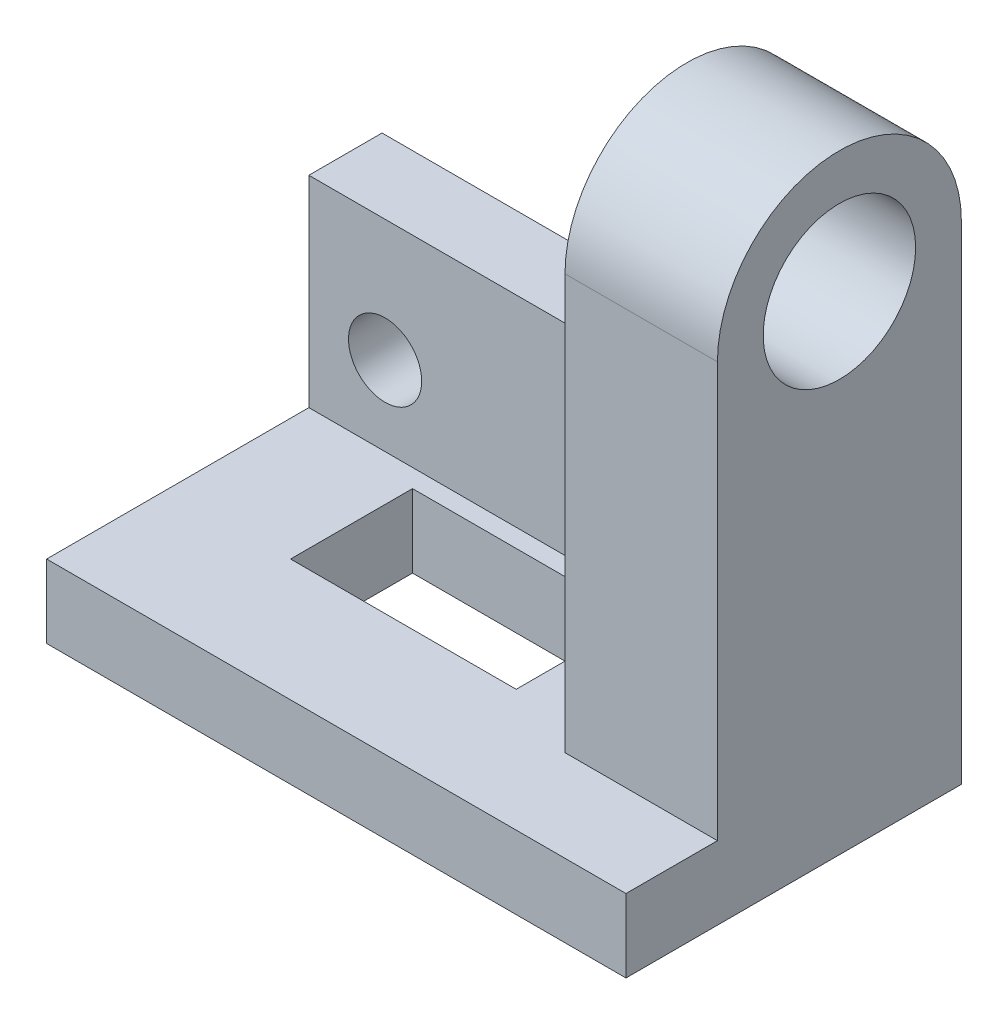
ISO-10303-21;
HEADER;
FILE_DESCRIPTION(('STEP AP214'),'2;1');
FILE_NAME('part.step','',(''),(''),'','','');
FILE_SCHEMA(('AUTOMOTIVE_DESIGN { 1 0 10303 214 1 1 1 1 }'));
ENDSEC;
DATA;
#1=APPLICATION_CONTEXT('core data for automotive mechanical design processes');
#2=APPLICATION_PROTOCOL_DEFINITION('international standard','automotive_design',2000,#1);
#3=PRODUCT_CONTEXT('',#1,'mechanical');
#4=PRODUCT('Part','Part','',(#3));
#5=PRODUCT_RELATED_PRODUCT_CATEGORY('part','',(#4));
#6=PRODUCT_DEFINITION_FORMATION('','',#4);
#7=PRODUCT_DEFINITION_CONTEXT('part definition',#1,'design');
#8=PRODUCT_DEFINITION('design','',#6,#7);
#9=PRODUCT_DEFINITION_SHAPE('','',#8);
#10=(LENGTH_UNIT() NAMED_UNIT(*) SI_UNIT(.MILLI.,.METRE.));
#11=(NAMED_UNIT(*) PLANE_ANGLE_UNIT() SI_UNIT($,.RADIAN.));
#12=(NAMED_UNIT(*) SI_UNIT($,.STERADIAN.) SOLID_ANGLE_UNIT());
#13=UNCERTAINTY_MEASURE_WITH_UNIT(LENGTH_MEASURE(1.E-05),#10,'distance_accuracy_value','');
#14=(GEOMETRIC_REPRESENTATION_CONTEXT(3) GLOBAL_UNCERTAINTY_ASSIGNED_CONTEXT((#13)) GLOBAL_UNIT_ASSIGNED_CONTEXT((#10,
#11,#12)) REPRESENTATION_CONTEXT('',''));
#15=CARTESIAN_POINT('',(0.,0.,0.));
#16=DIRECTION('',(0.,0.,1.));
#17=DIRECTION('',(1.,0.,0.));
#18=AXIS2_PLACEMENT_3D('',#15,#16,#17);
#19=CARTESIAN_POINT('',(-37.5143454039488,7.36086864256436,-12.));
#20=DIRECTION('',(-1.,0.,0.));
#21=DIRECTION('',(0.,0.,1.));
#22=AXIS2_PLACEMENT_3D('',#19,#20,#21);
#23=PLANE('',#22);
#24=DIRECTION('',(0.,-1.,0.));
#25=VECTOR('',#24,1.);
#26=CARTESIAN_POINT('',(-37.5143454039488,7.36086864256436,0.));
#27=LINE('',#26,#25);
#28=CARTESIAN_POINT('',(-37.5143454039488,7.36086864256436,0.));
#29=VERTEX_POINT('',#28);
#30=CARTESIAN_POINT('',(-37.5143454039488,-25.6391313574381,0.));
#31=VERTEX_POINT('',#30);
#32=EDGE_CURVE('E238',#29,#31,#27,.T.);
#33=ORIENTED_EDGE('',*,*,#32,.F.);
#34=DIRECTION('',(0.,0.,1.));
#35=VECTOR('',#34,1.);
#36=CARTESIAN_POINT('',(-37.5143454039488,7.36086864256436,-12.));
#37=LINE('',#36,#35);
#38=CARTESIAN_POINT('',(-37.5143454039488,7.36086864256436,-12.));
#39=VERTEX_POINT('',#38);
#40=EDGE_CURVE('E255',#39,#29,#37,.T.);
#41=ORIENTED_EDGE('',*,*,#40,.F.);
#42=DIRECTION('',(0.,-1.,0.));
#43=VECTOR('',#42,1.);
#44=CARTESIAN_POINT('',(-37.5143454039488,7.36086864256436,-12.));
#45=LINE('',#44,#43);
#46=CARTESIAN_POINT('',(-37.5143454039488,-37.6391313574381,-12.));
#47=VERTEX_POINT('',#46);
#48=EDGE_CURVE('E247',#39,#47,#45,.T.);
#49=ORIENTED_EDGE('',*,*,#48,.T.);
#50=DIRECTION('',(0.,0.,-1.));
#51=VECTOR('',#50,1.);
#52=CARTESIAN_POINT('',(-37.5143454039488,-37.6391313574381,43.));
#53=LINE('',#52,#51);
#54=CARTESIAN_POINT('',(-37.5143454039488,-37.6391313574381,43.));
#55=VERTEX_POINT('',#54);
#56=EDGE_CURVE('E186',#55,#47,#53,.T.);
#57=ORIENTED_EDGE('',*,*,#56,.F.);
#58=DIRECTION('',(0.,1.,0.));
#59=VECTOR('',#58,1.);
#60=CARTESIAN_POINT('',(-37.5143454039488,-37.6391313574381,43.));
#61=LINE('',#60,#59);
#62=CARTESIAN_POINT('',(-37.5143454039488,-25.6391313574381,43.));
#63=VERTEX_POINT('',#62);
#64=EDGE_CURVE('E192',#55,#63,#61,.T.);
#65=ORIENTED_EDGE('',*,*,#64,.T.);
#66=DIRECTION('',(0.,0.,-1.));
#67=VECTOR('',#66,1.);
#68=CARTESIAN_POINT('',(-37.5143454039488,-25.6391313574381,43.));
#69=LINE('',#68,#67);
#70=EDGE_CURVE('E184',#63,#31,#69,.T.);
#71=ORIENTED_EDGE('',*,*,#70,.T.);
#72=EDGE_LOOP('',(#33,#41,#49,#57,#65,#71));
#73=FACE_BOUND('',#72,.T.);
#74=ADVANCED_FACE('F37',(#73),#23,.T.);
#75=CARTESIAN_POINT('',(-37.5143454039488,7.36086864256436,-12.));
#76=DIRECTION('',(0.,1.,0.));
#77=DIRECTION('',(0.,0.,1.));
#78=AXIS2_PLACEMENT_3D('',#75,#76,#77);
#79=PLANE('',#78);
#80=DIRECTION('',(-1.,0.,0.));
#81=VECTOR('',#80,1.);
#82=CARTESIAN_POINT('',(-37.5143454039488,7.36086864256436,0.));
#83=LINE('',#82,#81);
#84=CARTESIAN_POINT('',(24.485654596049,7.36086864256436,0.));
#85=VERTEX_POINT('',#84);
#86=EDGE_CURVE('E250',#85,#29,#83,.T.);
#87=ORIENTED_EDGE('',*,*,#86,.F.);
#88=DIRECTION('',(0.,0.,1.));
#89=VECTOR('',#88,1.);
#90=CARTESIAN_POINT('',(24.485654596049,7.36086864256436,-12.));
#91=LINE('',#90,#89);
#92=CARTESIAN_POINT('',(24.485654596049,7.36086864256436,-12.));
#93=VERTEX_POINT('',#92);
#94=EDGE_CURVE('E58',#85,#93,#91,.F.);
#95=ORIENTED_EDGE('',*,*,#94,.T.);
#96=DIRECTION('',(-1.,0.,0.));
#97=VECTOR('',#96,1.);
#98=CARTESIAN_POINT('',(-37.5143454039488,7.36086864256436,-12.));
#99=LINE('',#98,#97);
#100=EDGE_CURVE('E253',#93,#39,#99,.T.);
#101=ORIENTED_EDGE('',*,*,#100,.T.);
#102=ORIENTED_EDGE('',*,*,#40,.T.);
#103=EDGE_LOOP('',(#87,#95,#101,#102));
#104=FACE_BOUND('',#103,.T.);
#105=ADVANCED_FACE('F283',(#104),#79,.T.);
#106=CARTESIAN_POINT('',(57.4856545960512,7.36086864256436,-12.));
#107=DIRECTION('',(1.,0.,0.));
#108=DIRECTION('',(0.,0.,-1.));
#109=AXIS2_PLACEMENT_3D('',#106,#107,#108);
#110=PLANE('',#109);
#111=CARTESIAN_POINT('',(57.4856545960512,42.3608686425619,8.));
#112=DIRECTION('',(1.,0.,0.));
#113=DIRECTION('',(0.,0.,-1.));
#114=AXIS2_PLACEMENT_3D('',#111,#112,#113);
#115=CIRCLE('',#114,12.5);
#116=CARTESIAN_POINT('',(57.4856545960512,42.3608686425619,-4.5));
#117=VERTEX_POINT('',#116);
#118=EDGE_CURVE('E203',#117,#117,#115,.T.);
#119=ORIENTED_EDGE('',*,*,#118,.F.);
#120=EDGE_LOOP('',(#119));
#121=FACE_BOUND('',#120,.T.);
#122=DIRECTION('',(0.,1.,0.));
#123=VECTOR('',#122,1.);
#124=CARTESIAN_POINT('',(57.4856545960512,7.36086864256436,-12.));
#125=LINE('',#124,#123);
#126=CARTESIAN_POINT('',(57.4856545960512,-37.6391313574381,-12.));
#127=VERTEX_POINT('',#126);
#128=CARTESIAN_POINT('',(57.4856545960512,42.3608686425619,-12.));
#129=VERTEX_POINT('',#128);
#130=EDGE_CURVE('E249',#127,#129,#125,.T.);
#131=ORIENTED_EDGE('',*,*,#130,.T.);
#132=CARTESIAN_POINT('',(57.4856545960512,42.3608686425619,8.));
#133=DIRECTION('',(1.,0.,0.));
#134=DIRECTION('',(0.,0.,-1.));
#135=AXIS2_PLACEMENT_3D('',#132,#133,#134);
#136=CIRCLE('',#135,20.);
#137=CARTESIAN_POINT('',(57.4856545960512,42.3608686425619,28.));
#138=VERTEX_POINT('',#137);
#139=EDGE_CURVE('E207',#129,#138,#136,.T.);
#140=ORIENTED_EDGE('',*,*,#139,.T.);
#141=DIRECTION('',(0.,1.,0.));
#142=VECTOR('',#141,1.);
#143=CARTESIAN_POINT('',(57.4856545960512,42.3608686425619,28.));
#144=LINE('',#143,#142);
#145=CARTESIAN_POINT('',(57.4856545960512,-25.6391313574381,28.));
#146=VERTEX_POINT('',#145);
#147=EDGE_CURVE('E217',#146,#138,#144,.T.);
#148=ORIENTED_EDGE('',*,*,#147,.F.);
#149=DIRECTION('',(0.,0.,1.));
#150=VECTOR('',#149,1.);
#151=CARTESIAN_POINT('',(57.4856545960512,-25.6391313574381,-12.));
#152=LINE('',#151,#150);
#153=CARTESIAN_POINT('',(57.4856545960512,-25.6391313574381,43.));
#154=VERTEX_POINT('',#153);
#155=EDGE_CURVE('E176',#146,#154,#152,.T.);
#156=ORIENTED_EDGE('',*,*,#155,.T.);
#157=DIRECTION('',(0.,1.,0.));
#158=VECTOR('',#157,1.);
#159=CARTESIAN_POINT('',(57.4856545960512,-37.6391313574381,43.));
#160=LINE('',#159,#158);
#161=CARTESIAN_POINT('',(57.4856545960512,-37.6391313574381,43.));
#162=VERTEX_POINT('',#161);
#163=EDGE_CURVE('E200',#162,#154,#160,.T.);
#164=ORIENTED_EDGE('',*,*,#163,.F.);
#165=DIRECTION('',(0.,0.,1.));
#166=VECTOR('',#165,1.);
#167=CARTESIAN_POINT('',(57.4856545960512,-37.6391313574381,-12.));
#168=LINE('',#167,#166);
#169=EDGE_CURVE('E180',#127,#162,#168,.T.);
#170=ORIENTED_EDGE('',*,*,#169,.F.);
#171=EDGE_LOOP('',(#131,#140,#148,#156,#164,#170));
#172=FACE_BOUND('',#171,.T.);
#173=ADVANCED_FACE('F300',(#121,#172),#110,.T.);
#174=CARTESIAN_POINT('',(0.,0.,-12.));
#175=DIRECTION('',(0.,0.,1.));
#176=DIRECTION('',(1.,0.,0.));
#177=AXIS2_PLACEMENT_3D('',#174,#175,#176);
#178=PLANE('',#177);
#179=CARTESIAN_POINT('',(-25.014345403951,-12.6391313574381,-12.));
#180=DIRECTION('',(0.,0.,1.));
#181=DIRECTION('',(1.,0.,0.));
#182=AXIS2_PLACEMENT_3D('',#179,#180,#181);
#183=CIRCLE('',#182,6.);
#184=CARTESIAN_POINT('',(-19.014345403951,-12.6391313574381,-12.));
#185=VERTEX_POINT('',#184);
#186=EDGE_CURVE('E235',#185,#185,#183,.T.);
#187=ORIENTED_EDGE('',*,*,#186,.T.);
#188=EDGE_LOOP('',(#187));
#189=FACE_BOUND('',#188,.T.);
#190=CARTESIAN_POINT('',(16.485654596049,-12.6391313574381,-12.));
#191=DIRECTION('',(0.,0.,1.));
#192=DIRECTION('',(1.,0.,0.));
#193=AXIS2_PLACEMENT_3D('',#190,#191,#192);
#194=CIRCLE('',#193,6.);
#195=CARTESIAN_POINT('',(22.485654596049,-12.6391313574381,-12.));
#196=VERTEX_POINT('',#195);
#197=EDGE_CURVE('E242',#196,#196,#194,.T.);
#198=ORIENTED_EDGE('',*,*,#197,.T.);
#199=EDGE_LOOP('',(#198));
#200=FACE_BOUND('',#199,.T.);
#201=ORIENTED_EDGE('',*,*,#100,.F.);
#202=CARTESIAN_POINT('',(24.485654596049,15.3608686425644,-12.));
#203=DIRECTION('',(0.,0.,1.));
#204=DIRECTION('',(1.,0.,0.));
#205=AXIS2_PLACEMENT_3D('',#202,#203,#204);
#206=CIRCLE('',#205,8.);
#207=CARTESIAN_POINT('',(32.485654596049,15.3608686425644,-12.));
#208=VERTEX_POINT('',#207);
#209=EDGE_CURVE('E11',#93,#208,#206,.T.);
#210=ORIENTED_EDGE('',*,*,#209,.T.);
#211=DIRECTION('',(0.,-1.,0.));
#212=VECTOR('',#211,1.);
#213=CARTESIAN_POINT('',(32.485654596049,42.3608686425619,-12.));
#214=LINE('',#213,#212);
#215=CARTESIAN_POINT('',(32.4856545960512,42.3608686425619,-12.));
#216=VERTEX_POINT('',#215);
#217=EDGE_CURVE('E228',#216,#208,#214,.T.);
#218=ORIENTED_EDGE('',*,*,#217,.F.);
#219=DIRECTION('',(-1.,0.,0.));
#220=VECTOR('',#219,1.);
#221=CARTESIAN_POINT('',(57.4856545960512,42.3608686425619,-12.));
#222=LINE('',#221,#220);
#223=EDGE_CURVE('E226',#129,#216,#222,.T.);
#224=ORIENTED_EDGE('',*,*,#223,.F.);
#225=ORIENTED_EDGE('',*,*,#130,.F.);
#226=DIRECTION('',(1.,0.,0.));
#227=VECTOR('',#226,1.);
#228=CARTESIAN_POINT('',(-37.5143454039488,-37.6391313574381,-12.));
#229=LINE('',#228,#227);
#230=EDGE_CURVE('E189',#47,#127,#229,.T.);
#231=ORIENTED_EDGE('',*,*,#230,.F.);
#232=ORIENTED_EDGE('',*,*,#48,.F.);
#233=EDGE_LOOP('',(#201,#210,#218,#224,#225,#231,#232));
#234=FACE_BOUND('',#233,.T.);
#235=ADVANCED_FACE('F278',(#189,#200,#234),#178,.F.);
#236=CARTESIAN_POINT('',(0.,0.,0.));
#237=DIRECTION('',(0.,0.,1.));
#238=DIRECTION('',(1.,0.,0.));
#239=AXIS2_PLACEMENT_3D('',#236,#237,#238);
#240=PLANE('',#239);
#241=DIRECTION('',(0.,-1.,0.));
#242=VECTOR('',#241,1.);
#243=CARTESIAN_POINT('',(32.485654596049,0.,0.));
#244=LINE('',#243,#242);
#245=CARTESIAN_POINT('',(32.485654596049,15.3608686425644,0.));
#246=VERTEX_POINT('',#245);
#247=CARTESIAN_POINT('',(32.485654596049,-25.6391313574381,0.));
#248=VERTEX_POINT('',#247);
#249=EDGE_CURVE('E264',#246,#248,#244,.T.);
#250=ORIENTED_EDGE('',*,*,#249,.F.);
#251=CARTESIAN_POINT('',(24.485654596049,15.3608686425644,0.));
#252=DIRECTION('',(0.,0.,1.));
#253=DIRECTION('',(1.,0.,0.));
#254=AXIS2_PLACEMENT_3D('',#251,#252,#253);
#255=CIRCLE('',#254,8.);
#256=EDGE_CURVE('E45',#246,#85,#255,.F.);
#257=ORIENTED_EDGE('',*,*,#256,.T.);
#258=ORIENTED_EDGE('',*,*,#86,.T.);
#259=ORIENTED_EDGE('',*,*,#32,.T.);
#260=DIRECTION('',(1.,0.,0.));
#261=VECTOR('',#260,1.);
#262=CARTESIAN_POINT('',(-37.5143454039488,-25.6391313574381,0.));
#263=LINE('',#262,#261);
#264=EDGE_CURVE('E258',#31,#248,#263,.T.);
#265=ORIENTED_EDGE('',*,*,#264,.T.);
#266=EDGE_LOOP('',(#250,#257,#258,#259,#265));
#267=FACE_BOUND('',#266,.T.);
#268=CARTESIAN_POINT('',(-25.014345403951,-12.6391313574381,0.));
#269=DIRECTION('',(0.,0.,1.));
#270=DIRECTION('',(1.,0.,0.));
#271=AXIS2_PLACEMENT_3D('',#268,#269,#270);
#272=CIRCLE('',#271,6.);
#273=CARTESIAN_POINT('',(-19.014345403951,-12.6391313574381,0.));
#274=VERTEX_POINT('',#273);
#275=EDGE_CURVE('E239',#274,#274,#272,.T.);
#276=ORIENTED_EDGE('',*,*,#275,.F.);
#277=EDGE_LOOP('',(#276));
#278=FACE_BOUND('',#277,.T.);
#279=CARTESIAN_POINT('',(16.485654596049,-12.6391313574381,0.));
#280=DIRECTION('',(0.,0.,1.));
#281=DIRECTION('',(1.,0.,0.));
#282=AXIS2_PLACEMENT_3D('',#279,#280,#281);
#283=CIRCLE('',#282,6.);
#284=CARTESIAN_POINT('',(22.485654596049,-12.6391313574381,0.));
#285=VERTEX_POINT('',#284);
#286=EDGE_CURVE('E234',#285,#285,#283,.T.);
#287=ORIENTED_EDGE('',*,*,#286,.F.);
#288=EDGE_LOOP('',(#287));
#289=FACE_BOUND('',#288,.T.);
#290=ADVANCED_FACE('F288',(#267,#278,#289),#240,.T.);
#291=CARTESIAN_POINT('',(16.485654596049,-12.6391313574381,-12.));
#292=DIRECTION('',(0.,0.,1.));
#293=DIRECTION('',(1.,0.,0.));
#294=AXIS2_PLACEMENT_3D('',#291,#292,#293);
#295=CYLINDRICAL_SURFACE('',#294,6.);
#296=ORIENTED_EDGE('',*,*,#197,.F.);
#297=EDGE_LOOP('',(#296));
#298=FACE_BOUND('',#297,.T.);
#299=ORIENTED_EDGE('',*,*,#286,.T.);
#300=EDGE_LOOP('',(#299));
#301=FACE_BOUND('',#300,.T.);
#302=ADVANCED_FACE('F328',(#298,#301),#295,.F.);
#303=CARTESIAN_POINT('',(-25.014345403951,-12.6391313574381,-12.));
#304=DIRECTION('',(0.,0.,1.));
#305=DIRECTION('',(1.,0.,0.));
#306=AXIS2_PLACEMENT_3D('',#303,#304,#305);
#307=CYLINDRICAL_SURFACE('',#306,6.);
#308=ORIENTED_EDGE('',*,*,#186,.F.);
#309=EDGE_LOOP('',(#308));
#310=FACE_BOUND('',#309,.T.);
#311=ORIENTED_EDGE('',*,*,#275,.T.);
#312=EDGE_LOOP('',(#311));
#313=FACE_BOUND('',#312,.T.);
#314=ADVANCED_FACE('F334',(#310,#313),#307,.F.);
#315=CARTESIAN_POINT('',(32.485654596049,42.3608686425619,-12.));
#316=DIRECTION('',(-1.,0.,0.));
#317=DIRECTION('',(0.,-1.,0.));
#318=AXIS2_PLACEMENT_3D('',#315,#316,#317);
#319=PLANE('',#318);
#320=CARTESIAN_POINT('',(32.4856545960512,42.3608686425619,8.));
#321=DIRECTION('',(1.,0.,0.));
#322=DIRECTION('',(0.,0.,-1.));
#323=AXIS2_PLACEMENT_3D('',#320,#321,#322);
#324=CIRCLE('',#323,12.5);
#325=CARTESIAN_POINT('',(32.4856545960512,42.3608686425619,-4.5));
#326=VERTEX_POINT('',#325);
#327=EDGE_CURVE('E204',#326,#326,#324,.T.);
#328=ORIENTED_EDGE('',*,*,#327,.T.);
#329=EDGE_LOOP('',(#328));
#330=FACE_BOUND('',#329,.T.);
#331=ORIENTED_EDGE('',*,*,#217,.T.);
#332=DIRECTION('',(0.,0.,1.));
#333=VECTOR('',#332,1.);
#334=CARTESIAN_POINT('',(32.485654596049,15.3608686425644,0.));
#335=LINE('',#334,#333);
#336=EDGE_CURVE('E267',#208,#246,#335,.T.);
#337=ORIENTED_EDGE('',*,*,#336,.T.);
#338=ORIENTED_EDGE('',*,*,#249,.T.);
#339=DIRECTION('',(0.,0.,1.));
#340=VECTOR('',#339,1.);
#341=CARTESIAN_POINT('',(32.485654596049,-25.6391313574381,-12.));
#342=LINE('',#341,#340);
#343=CARTESIAN_POINT('',(32.485654596049,-25.6391313574381,28.));
#344=VERTEX_POINT('',#343);
#345=EDGE_CURVE('E231',#248,#344,#342,.T.);
#346=ORIENTED_EDGE('',*,*,#345,.T.);
#347=DIRECTION('',(0.,-1.,0.));
#348=VECTOR('',#347,1.);
#349=CARTESIAN_POINT('',(32.485654596049,42.3608686425619,28.));
#350=LINE('',#349,#348);
#351=CARTESIAN_POINT('',(32.485654596049,42.3608686425619,28.));
#352=VERTEX_POINT('',#351);
#353=EDGE_CURVE('E223',#352,#344,#350,.T.);
#354=ORIENTED_EDGE('',*,*,#353,.F.);
#355=CARTESIAN_POINT('',(32.4856545960512,42.3608686425619,8.));
#356=DIRECTION('',(1.,0.,0.));
#357=DIRECTION('',(0.,0.,-1.));
#358=AXIS2_PLACEMENT_3D('',#355,#356,#357);
#359=CIRCLE('',#358,20.);
#360=EDGE_CURVE('E210',#216,#352,#359,.T.);
#361=ORIENTED_EDGE('',*,*,#360,.F.);
#362=EDGE_LOOP('',(#331,#337,#338,#346,#354,#361));
#363=FACE_BOUND('',#362,.T.);
#364=ADVANCED_FACE('F272',(#330,#363),#319,.T.);
#365=CARTESIAN_POINT('',(0.,0.,28.));
#366=DIRECTION('',(0.,0.,1.));
#367=DIRECTION('',(1.,0.,0.));
#368=AXIS2_PLACEMENT_3D('',#365,#366,#367);
#369=PLANE('',#368);
#370=DIRECTION('',(1.,0.,0.));
#371=VECTOR('',#370,1.);
#372=CARTESIAN_POINT('',(57.4856545960512,-25.6391313574381,28.));
#373=LINE('',#372,#371);
#374=EDGE_CURVE('E212',#344,#146,#373,.T.);
#375=ORIENTED_EDGE('',*,*,#374,.T.);
#376=ORIENTED_EDGE('',*,*,#147,.T.);
#377=DIRECTION('',(-1.,0.,0.));
#378=VECTOR('',#377,1.);
#379=CARTESIAN_POINT('',(57.4856545960512,42.3608686425619,28.));
#380=LINE('',#379,#378);
#381=EDGE_CURVE('E220',#138,#352,#380,.T.);
#382=ORIENTED_EDGE('',*,*,#381,.T.);
#383=ORIENTED_EDGE('',*,*,#353,.T.);
#384=EDGE_LOOP('',(#375,#376,#382,#383));
#385=FACE_BOUND('',#384,.T.);
#386=ADVANCED_FACE('F295',(#385),#369,.T.);
#387=CARTESIAN_POINT('',(32.4856545960512,42.3608686425619,8.));
#388=DIRECTION('',(1.,0.,0.));
#389=DIRECTION('',(0.,0.,-1.));
#390=AXIS2_PLACEMENT_3D('',#387,#388,#389);
#391=CYLINDRICAL_SURFACE('',#390,20.);
#392=ORIENTED_EDGE('',*,*,#139,.F.);
#393=ORIENTED_EDGE('',*,*,#223,.T.);
#394=ORIENTED_EDGE('',*,*,#360,.T.);
#395=ORIENTED_EDGE('',*,*,#381,.F.);
#396=EDGE_LOOP('',(#392,#393,#394,#395));
#397=FACE_BOUND('',#396,.T.);
#398=ADVANCED_FACE('F298',(#397),#391,.T.);
#399=CARTESIAN_POINT('',(32.4856545960512,42.3608686425619,8.));
#400=DIRECTION('',(1.,0.,0.));
#401=DIRECTION('',(0.,0.,-1.));
#402=AXIS2_PLACEMENT_3D('',#399,#400,#401);
#403=CYLINDRICAL_SURFACE('',#402,12.5);
#404=ORIENTED_EDGE('',*,*,#327,.F.);
#405=EDGE_LOOP('',(#404));
#406=FACE_BOUND('',#405,.T.);
#407=ORIENTED_EDGE('',*,*,#118,.T.);
#408=EDGE_LOOP('',(#407));
#409=FACE_BOUND('',#408,.T.);
#410=ADVANCED_FACE('F307',(#406,#409),#403,.F.);
#411=CARTESIAN_POINT('',(57.4856545960512,-37.6391313574381,43.));
#412=DIRECTION('',(0.,0.,-1.));
#413=DIRECTION('',(-1.,0.,0.));
#414=AXIS2_PLACEMENT_3D('',#411,#412,#413);
#415=PLANE('',#414);
#416=DIRECTION('',(-1.,0.,0.));
#417=VECTOR('',#416,1.);
#418=CARTESIAN_POINT('',(57.4856545960512,-25.6391313574381,43.));
#419=LINE('',#418,#417);
#420=EDGE_CURVE('E194',#154,#63,#419,.T.);
#421=ORIENTED_EDGE('',*,*,#420,.T.);
#422=ORIENTED_EDGE('',*,*,#64,.F.);
#423=DIRECTION('',(-1.,0.,0.));
#424=VECTOR('',#423,1.);
#425=CARTESIAN_POINT('',(57.4856545960512,-37.6391313574381,43.));
#426=LINE('',#425,#424);
#427=EDGE_CURVE('E183',#162,#55,#426,.T.);
#428=ORIENTED_EDGE('',*,*,#427,.F.);
#429=ORIENTED_EDGE('',*,*,#163,.T.);
#430=EDGE_LOOP('',(#421,#422,#428,#429));
#431=FACE_BOUND('',#430,.T.);
#432=ADVANCED_FACE('F305',(#431),#415,.F.);
#433=CARTESIAN_POINT('',(0.,-37.6391313574381,0.));
#434=DIRECTION('',(0.,-1.,0.));
#435=DIRECTION('',(0.,0.,-1.));
#436=AXIS2_PLACEMENT_3D('',#433,#434,#435);
#437=PLANE('',#436);
#438=DIRECTION('',(0.,0.,-1.));
#439=VECTOR('',#438,1.);
#440=CARTESIAN_POINT('',(19.485654596049,-37.6391313574381,23.));
#441=LINE('',#440,#439);
#442=CARTESIAN_POINT('',(19.485654596049,-37.6391313574381,23.));
#443=VERTEX_POINT('',#442);
#444=CARTESIAN_POINT('',(19.485654596049,-37.6391313574381,3.));
#445=VERTEX_POINT('',#444);
#446=EDGE_CURVE('E140',#443,#445,#441,.T.);
#447=ORIENTED_EDGE('',*,*,#446,.T.);
#448=DIRECTION('',(-1.,0.,0.));
#449=VECTOR('',#448,1.);
#450=CARTESIAN_POINT('',(-17.514345403951,-37.6391313574381,3.));
#451=LINE('',#450,#449);
#452=CARTESIAN_POINT('',(-17.514345403951,-37.6391313574381,3.));
#453=VERTEX_POINT('',#452);
#454=EDGE_CURVE('E152',#445,#453,#451,.T.);
#455=ORIENTED_EDGE('',*,*,#454,.T.);
#456=DIRECTION('',(0.,0.,1.));
#457=VECTOR('',#456,1.);
#458=CARTESIAN_POINT('',(-17.514345403951,-37.6391313574381,23.));
#459=LINE('',#458,#457);
#460=CARTESIAN_POINT('',(-17.514345403951,-37.6391313574381,23.));
#461=VERTEX_POINT('',#460);
#462=EDGE_CURVE('E156',#453,#461,#459,.T.);
#463=ORIENTED_EDGE('',*,*,#462,.T.);
#464=DIRECTION('',(1.,0.,0.));
#465=VECTOR('',#464,1.);
#466=CARTESIAN_POINT('',(-17.514345403951,-37.6391313574381,23.));
#467=LINE('',#466,#465);
#468=EDGE_CURVE('E148',#461,#443,#467,.T.);
#469=ORIENTED_EDGE('',*,*,#468,.T.);
#470=EDGE_LOOP('',(#447,#455,#463,#469));
#471=FACE_BOUND('',#470,.T.);
#472=ORIENTED_EDGE('',*,*,#169,.T.);
#473=ORIENTED_EDGE('',*,*,#427,.T.);
#474=ORIENTED_EDGE('',*,*,#56,.T.);
#475=ORIENTED_EDGE('',*,*,#230,.T.);
#476=EDGE_LOOP('',(#472,#473,#474,#475));
#477=FACE_BOUND('',#476,.T.);
#478=ADVANCED_FACE('F158',(#471,#477),#437,.T.);
#479=CARTESIAN_POINT('',(0.,-25.6391313574381,0.));
#480=DIRECTION('',(0.,-1.,0.));
#481=DIRECTION('',(0.,0.,-1.));
#482=AXIS2_PLACEMENT_3D('',#479,#480,#481);
#483=PLANE('',#482);
#484=DIRECTION('',(-1.,0.,0.));
#485=VECTOR('',#484,1.);
#486=CARTESIAN_POINT('',(-17.514345403951,-25.6391313574381,3.));
#487=LINE('',#486,#485);
#488=CARTESIAN_POINT('',(19.485654596049,-25.6391313574381,3.));
#489=VERTEX_POINT('',#488);
#490=CARTESIAN_POINT('',(-17.514345403951,-25.6391313574381,3.));
#491=VERTEX_POINT('',#490);
#492=EDGE_CURVE('E170',#489,#491,#487,.T.);
#493=ORIENTED_EDGE('',*,*,#492,.F.);
#494=DIRECTION('',(0.,0.,-1.));
#495=VECTOR('',#494,1.);
#496=CARTESIAN_POINT('',(19.485654596049,-25.6391313574381,23.));
#497=LINE('',#496,#495);
#498=CARTESIAN_POINT('',(19.485654596049,-25.6391313574381,23.));
#499=VERTEX_POINT('',#498);
#500=EDGE_CURVE('E143',#499,#489,#497,.T.);
#501=ORIENTED_EDGE('',*,*,#500,.F.);
#502=DIRECTION('',(1.,0.,0.));
#503=VECTOR('',#502,1.);
#504=CARTESIAN_POINT('',(-17.514345403951,-25.6391313574381,23.));
#505=LINE('',#504,#503);
#506=CARTESIAN_POINT('',(-17.514345403951,-25.6391313574381,23.));
#507=VERTEX_POINT('',#506);
#508=EDGE_CURVE('E161',#507,#499,#505,.T.);
#509=ORIENTED_EDGE('',*,*,#508,.F.);
#510=DIRECTION('',(0.,0.,1.));
#511=VECTOR('',#510,1.);
#512=CARTESIAN_POINT('',(-17.514345403951,-25.6391313574381,23.));
#513=LINE('',#512,#511);
#514=EDGE_CURVE('E164',#491,#507,#513,.T.);
#515=ORIENTED_EDGE('',*,*,#514,.F.);
#516=EDGE_LOOP('',(#493,#501,#509,#515));
#517=FACE_BOUND('',#516,.T.);
#518=ORIENTED_EDGE('',*,*,#374,.F.);
#519=ORIENTED_EDGE('',*,*,#345,.F.);
#520=ORIENTED_EDGE('',*,*,#264,.F.);
#521=ORIENTED_EDGE('',*,*,#70,.F.);
#522=ORIENTED_EDGE('',*,*,#420,.F.);
#523=ORIENTED_EDGE('',*,*,#155,.F.);
#524=EDGE_LOOP('',(#518,#519,#520,#521,#522,#523));
#525=FACE_BOUND('',#524,.T.);
#526=ADVANCED_FACE('F291',(#517,#525),#483,.F.);
#527=CARTESIAN_POINT('',(19.485654596049,-37.6391313574381,23.));
#528=DIRECTION('',(1.,0.,0.));
#529=DIRECTION('',(0.,0.,-1.));
#530=AXIS2_PLACEMENT_3D('',#527,#528,#529);
#531=PLANE('',#530);
#532=ORIENTED_EDGE('',*,*,#500,.T.);
#533=DIRECTION('',(0.,1.,0.));
#534=VECTOR('',#533,1.);
#535=CARTESIAN_POINT('',(19.485654596049,-37.6391313574381,3.));
#536=LINE('',#535,#534);
#537=EDGE_CURVE('E136',#445,#489,#536,.T.);
#538=ORIENTED_EDGE('',*,*,#537,.F.);
#539=ORIENTED_EDGE('',*,*,#446,.F.);
#540=DIRECTION('',(0.,1.,0.));
#541=VECTOR('',#540,1.);
#542=CARTESIAN_POINT('',(19.485654596049,-37.6391313574381,23.));
#543=LINE('',#542,#541);
#544=EDGE_CURVE('E174',#443,#499,#543,.T.);
#545=ORIENTED_EDGE('',*,*,#544,.T.);
#546=EDGE_LOOP('',(#532,#538,#539,#545));
#547=FACE_BOUND('',#546,.T.);
#548=ADVANCED_FACE('F138',(#547),#531,.F.);
#549=CARTESIAN_POINT('',(-17.514345403951,-37.6391313574381,23.));
#550=DIRECTION('',(0.,0.,1.));
#551=DIRECTION('',(1.,0.,0.));
#552=AXIS2_PLACEMENT_3D('',#549,#550,#551);
#553=PLANE('',#552);
#554=ORIENTED_EDGE('',*,*,#508,.T.);
#555=ORIENTED_EDGE('',*,*,#544,.F.);
#556=ORIENTED_EDGE('',*,*,#468,.F.);
#557=DIRECTION('',(0.,1.,0.));
#558=VECTOR('',#557,1.);
#559=CARTESIAN_POINT('',(-17.514345403951,-37.6391313574381,23.));
#560=LINE('',#559,#558);
#561=EDGE_CURVE('E177',#461,#507,#560,.T.);
#562=ORIENTED_EDGE('',*,*,#561,.T.);
#563=EDGE_LOOP('',(#554,#555,#556,#562));
#564=FACE_BOUND('',#563,.T.);
#565=ADVANCED_FACE('F399',(#564),#553,.F.);
#566=CARTESIAN_POINT('',(-17.514345403951,-37.6391313574381,23.));
#567=DIRECTION('',(-1.,0.,0.));
#568=DIRECTION('',(0.,0.,1.));
#569=AXIS2_PLACEMENT_3D('',#566,#567,#568);
#570=PLANE('',#569);
#571=ORIENTED_EDGE('',*,*,#514,.T.);
#572=ORIENTED_EDGE('',*,*,#561,.F.);
#573=ORIENTED_EDGE('',*,*,#462,.F.);
#574=DIRECTION('',(0.,1.,0.));
#575=VECTOR('',#574,1.);
#576=CARTESIAN_POINT('',(-17.514345403951,-37.6391313574381,3.));
#577=LINE('',#576,#575);
#578=EDGE_CURVE('E147',#453,#491,#577,.T.);
#579=ORIENTED_EDGE('',*,*,#578,.T.);
#580=EDGE_LOOP('',(#571,#572,#573,#579));
#581=FACE_BOUND('',#580,.T.);
#582=ADVANCED_FACE('F408',(#581),#570,.F.);
#583=CARTESIAN_POINT('',(-17.514345403951,-37.6391313574381,3.));
#584=DIRECTION('',(0.,0.,-1.));
#585=DIRECTION('',(-1.,0.,0.));
#586=AXIS2_PLACEMENT_3D('',#583,#584,#585);
#587=PLANE('',#586);
#588=ORIENTED_EDGE('',*,*,#492,.T.);
#589=ORIENTED_EDGE('',*,*,#578,.F.);
#590=ORIENTED_EDGE('',*,*,#454,.F.);
#591=ORIENTED_EDGE('',*,*,#537,.T.);
#592=EDGE_LOOP('',(#588,#589,#590,#591));
#593=FACE_BOUND('',#592,.T.);
#594=ADVANCED_FACE('F153',(#593),#587,.F.);
#595=CARTESIAN_POINT('',(24.485654596049,15.3608686425644,-12.));
#596=DIRECTION('',(0.,0.,-1.));
#597=DIRECTION('',(-1.,0.,0.));
#598=AXIS2_PLACEMENT_3D('',#595,#596,#597);
#599=CYLINDRICAL_SURFACE('',#598,8.);
#600=ORIENTED_EDGE('',*,*,#209,.F.);
#601=ORIENTED_EDGE('',*,*,#94,.F.);
#602=ORIENTED_EDGE('',*,*,#256,.F.);
#603=ORIENTED_EDGE('',*,*,#336,.F.);
#604=EDGE_LOOP('',(#600,#601,#602,#603));
#605=FACE_BOUND('',#604,.T.);
#606=ADVANCED_FACE('F39',(#605),#599,.F.);
#607=CLOSED_SHELL('',(#74,#105,#173,#235,#290,#302,#314,#364,#386,#398,#410,#432,#478,#526,#548,
#565,#582,#594,#606));
#608=MANIFOLD_SOLID_BREP('B2',#607);
#609=ADVANCED_BREP_SHAPE_REPRESENTATION('',(#18,#608),#14);
#610=SHAPE_DEFINITION_REPRESENTATION(#9,#609);
ENDSEC;
END-ISO-10303-21;
